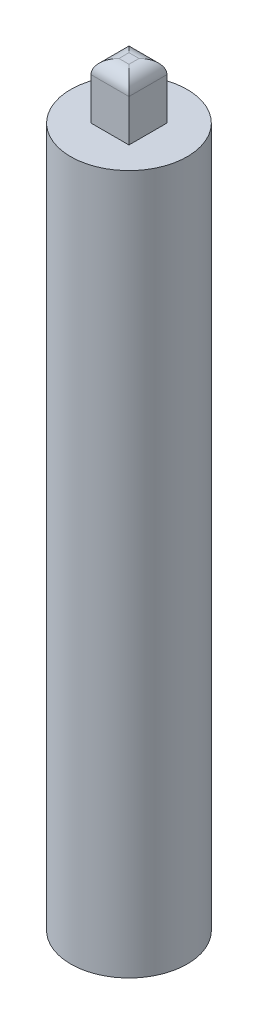
ISO-10303-21;
HEADER;
FILE_DESCRIPTION(('STEP AP214'),'2;1');
FILE_NAME('part.step','',(''),(''),'','','');
FILE_SCHEMA(('AUTOMOTIVE_DESIGN { 1 0 10303 214 1 1 1 1 }'));
ENDSEC;
DATA;
#1=APPLICATION_CONTEXT('core data for automotive mechanical design processes');
#2=APPLICATION_PROTOCOL_DEFINITION('international standard','automotive_design',2000,#1);
#3=PRODUCT_CONTEXT('',#1,'mechanical');
#4=PRODUCT('Part','Part','',(#3));
#5=PRODUCT_RELATED_PRODUCT_CATEGORY('part','',(#4));
#6=PRODUCT_DEFINITION_FORMATION('','',#4);
#7=PRODUCT_DEFINITION_CONTEXT('part definition',#1,'design');
#8=PRODUCT_DEFINITION('design','',#6,#7);
#9=PRODUCT_DEFINITION_SHAPE('','',#8);
#10=(LENGTH_UNIT() NAMED_UNIT(*) SI_UNIT(.MILLI.,.METRE.));
#11=(NAMED_UNIT(*) PLANE_ANGLE_UNIT() SI_UNIT($,.RADIAN.));
#12=(NAMED_UNIT(*) SI_UNIT($,.STERADIAN.) SOLID_ANGLE_UNIT());
#13=UNCERTAINTY_MEASURE_WITH_UNIT(LENGTH_MEASURE(1.E-05),#10,'distance_accuracy_value','');
#14=(GEOMETRIC_REPRESENTATION_CONTEXT(3) GLOBAL_UNCERTAINTY_ASSIGNED_CONTEXT((#13)) GLOBAL_UNIT_ASSIGNED_CONTEXT((#10,
#11,#12)) REPRESENTATION_CONTEXT('',''));
#15=CARTESIAN_POINT('',(0.,0.,0.));
#16=DIRECTION('',(0.,0.,1.));
#17=DIRECTION('',(1.,0.,0.));
#18=AXIS2_PLACEMENT_3D('',#15,#16,#17);
#19=CARTESIAN_POINT('',(0.,150.,0.));
#20=DIRECTION('',(0.,-1.,0.));
#21=DIRECTION('',(0.,0.,-1.));
#22=AXIS2_PLACEMENT_3D('',#19,#20,#21);
#23=CYLINDRICAL_SURFACE('',#22,12.5);
#24=CARTESIAN_POINT('',(0.,150.,0.));
#25=DIRECTION('',(0.,1.,0.));
#26=DIRECTION('',(0.,0.,1.));
#27=AXIS2_PLACEMENT_3D('',#24,#25,#26);
#28=CIRCLE('',#27,12.5);
#29=CARTESIAN_POINT('',(0.,150.,12.5));
#30=VERTEX_POINT('',#29);
#31=EDGE_CURVE('E198',#30,#30,#28,.T.);
#32=ORIENTED_EDGE('',*,*,#31,.F.);
#33=EDGE_LOOP('',(#32));
#34=FACE_BOUND('',#33,.T.);
#35=CARTESIAN_POINT('',(0.,0.,0.));
#36=DIRECTION('',(0.,1.,0.));
#37=DIRECTION('',(0.,0.,1.));
#38=AXIS2_PLACEMENT_3D('',#35,#36,#37);
#39=CIRCLE('',#38,12.5);
#40=CARTESIAN_POINT('',(0.,0.,12.5));
#41=VERTEX_POINT('',#40);
#42=EDGE_CURVE('E197',#41,#41,#39,.T.);
#43=ORIENTED_EDGE('',*,*,#42,.T.);
#44=EDGE_LOOP('',(#43));
#45=FACE_BOUND('',#44,.T.);
#46=ADVANCED_FACE('F39',(#34,#45),#23,.T.);
#47=CARTESIAN_POINT('',(0.,150.,0.));
#48=DIRECTION('',(0.,1.,0.));
#49=DIRECTION('',(0.,0.,1.));
#50=AXIS2_PLACEMENT_3D('',#47,#48,#49);
#51=PLANE('',#50);
#52=DIRECTION('',(0.,0.,-1.));
#53=VECTOR('',#52,1.);
#54=CARTESIAN_POINT('',(4.075,150.,-4.075));
#55=LINE('',#54,#53);
#56=CARTESIAN_POINT('',(4.075,150.,4.075));
#57=VERTEX_POINT('',#56);
#58=CARTESIAN_POINT('',(4.075,150.,-4.075));
#59=VERTEX_POINT('',#58);
#60=EDGE_CURVE('E169',#57,#59,#55,.T.);
#61=ORIENTED_EDGE('',*,*,#60,.F.);
#62=DIRECTION('',(1.,0.,0.));
#63=VECTOR('',#62,1.);
#64=CARTESIAN_POINT('',(-4.075,150.,4.075));
#65=LINE('',#64,#63);
#66=CARTESIAN_POINT('',(-4.075,150.,4.075));
#67=VERTEX_POINT('',#66);
#68=EDGE_CURVE('E181',#67,#57,#65,.T.);
#69=ORIENTED_EDGE('',*,*,#68,.F.);
#70=DIRECTION('',(0.,0.,1.));
#71=VECTOR('',#70,1.);
#72=CARTESIAN_POINT('',(-4.075,150.,-4.075));
#73=LINE('',#72,#71);
#74=CARTESIAN_POINT('',(-4.075,150.,-4.075));
#75=VERTEX_POINT('',#74);
#76=EDGE_CURVE('E177',#75,#67,#73,.T.);
#77=ORIENTED_EDGE('',*,*,#76,.F.);
#78=DIRECTION('',(-1.,0.,0.));
#79=VECTOR('',#78,1.);
#80=CARTESIAN_POINT('',(-4.075,150.,-4.075));
#81=LINE('',#80,#79);
#82=EDGE_CURVE('E173',#59,#75,#81,.T.);
#83=ORIENTED_EDGE('',*,*,#82,.F.);
#84=EDGE_LOOP('',(#61,#69,#77,#83));
#85=FACE_BOUND('',#84,.T.);
#86=ORIENTED_EDGE('',*,*,#31,.T.);
#87=EDGE_LOOP('',(#86));
#88=FACE_BOUND('',#87,.T.);
#89=ADVANCED_FACE('F274',(#85,#88),#51,.T.);
#90=CARTESIAN_POINT('',(0.,0.,0.));
#91=DIRECTION('',(0.,1.,0.));
#92=DIRECTION('',(0.,0.,1.));
#93=AXIS2_PLACEMENT_3D('',#90,#91,#92);
#94=PLANE('',#93);
#95=DIRECTION('',(1.,0.,0.));
#96=VECTOR('',#95,1.);
#97=CARTESIAN_POINT('',(4.1,0.,-4.1));
#98=LINE('',#97,#96);
#99=CARTESIAN_POINT('',(-4.1,0.,-4.1));
#100=VERTEX_POINT('',#99);
#101=CARTESIAN_POINT('',(4.1,0.,-4.1));
#102=VERTEX_POINT('',#101);
#103=EDGE_CURVE('E154',#100,#102,#98,.T.);
#104=ORIENTED_EDGE('',*,*,#103,.F.);
#105=DIRECTION('',(0.,0.,-1.));
#106=VECTOR('',#105,1.);
#107=CARTESIAN_POINT('',(-4.1,0.,-4.1));
#108=LINE('',#107,#106);
#109=CARTESIAN_POINT('',(-4.1,0.,4.1));
#110=VERTEX_POINT('',#109);
#111=EDGE_CURVE('E57',#110,#100,#108,.T.);
#112=ORIENTED_EDGE('',*,*,#111,.F.);
#113=DIRECTION('',(-1.,0.,0.));
#114=VECTOR('',#113,1.);
#115=CARTESIAN_POINT('',(4.1,0.,4.1));
#116=LINE('',#115,#114);
#117=CARTESIAN_POINT('',(4.1,0.,4.1));
#118=VERTEX_POINT('',#117);
#119=EDGE_CURVE('E141',#118,#110,#116,.T.);
#120=ORIENTED_EDGE('',*,*,#119,.F.);
#121=DIRECTION('',(0.,0.,1.));
#122=VECTOR('',#121,1.);
#123=CARTESIAN_POINT('',(4.1,0.,-4.1));
#124=LINE('',#123,#122);
#125=EDGE_CURVE('E145',#102,#118,#124,.T.);
#126=ORIENTED_EDGE('',*,*,#125,.F.);
#127=EDGE_LOOP('',(#104,#112,#120,#126));
#128=FACE_BOUND('',#127,.T.);
#129=ORIENTED_EDGE('',*,*,#42,.F.);
#130=EDGE_LOOP('',(#129));
#131=FACE_BOUND('',#130,.T.);
#132=ADVANCED_FACE('F280',(#128,#131),#94,.F.);
#133=CARTESIAN_POINT('',(4.075,162.,-4.075));
#134=DIRECTION('',(-1.,0.,0.));
#135=DIRECTION('',(0.,0.,1.));
#136=AXIS2_PLACEMENT_3D('',#133,#134,#135);
#137=PLANE('',#136);
#138=DIRECTION('',(0.,-1.,0.));
#139=VECTOR('',#138,1.);
#140=CARTESIAN_POINT('',(4.075,162.,-4.075));
#141=LINE('',#140,#139);
#142=CARTESIAN_POINT('',(4.075,159.,-4.075));
#143=VERTEX_POINT('',#142);
#144=EDGE_CURVE('E194',#143,#59,#141,.T.);
#145=ORIENTED_EDGE('',*,*,#144,.F.);
#146=DIRECTION('',(0.,0.,-1.));
#147=VECTOR('',#146,1.);
#148=CARTESIAN_POINT('',(4.075,159.,4.075));
#149=LINE('',#148,#147);
#150=CARTESIAN_POINT('',(4.075,159.,4.075));
#151=VERTEX_POINT('',#150);
#152=EDGE_CURVE('E222',#143,#151,#149,.F.);
#153=ORIENTED_EDGE('',*,*,#152,.T.);
#154=DIRECTION('',(0.,-1.,0.));
#155=VECTOR('',#154,1.);
#156=CARTESIAN_POINT('',(4.075,162.,4.075));
#157=LINE('',#156,#155);
#158=EDGE_CURVE('E185',#151,#57,#157,.T.);
#159=ORIENTED_EDGE('',*,*,#158,.T.);
#160=ORIENTED_EDGE('',*,*,#60,.T.);
#161=EDGE_LOOP('',(#145,#153,#159,#160));
#162=FACE_BOUND('',#161,.T.);
#163=ADVANCED_FACE('F381',(#162),#137,.F.);
#164=CARTESIAN_POINT('',(-4.075,162.,-4.075));
#165=DIRECTION('',(0.,0.,1.));
#166=DIRECTION('',(1.,0.,0.));
#167=AXIS2_PLACEMENT_3D('',#164,#165,#166);
#168=PLANE('',#167);
#169=DIRECTION('',(0.,-1.,0.));
#170=VECTOR('',#169,1.);
#171=CARTESIAN_POINT('',(-4.075,162.,-4.075));
#172=LINE('',#171,#170);
#173=CARTESIAN_POINT('',(-4.075,159.,-4.075));
#174=VERTEX_POINT('',#173);
#175=EDGE_CURVE('E191',#174,#75,#172,.T.);
#176=ORIENTED_EDGE('',*,*,#175,.F.);
#177=DIRECTION('',(-1.,0.,0.));
#178=VECTOR('',#177,1.);
#179=CARTESIAN_POINT('',(4.075,159.,-4.075));
#180=LINE('',#179,#178);
#181=EDGE_CURVE('E218',#174,#143,#180,.F.);
#182=ORIENTED_EDGE('',*,*,#181,.T.);
#183=ORIENTED_EDGE('',*,*,#144,.T.);
#184=ORIENTED_EDGE('',*,*,#82,.T.);
#185=EDGE_LOOP('',(#176,#182,#183,#184));
#186=FACE_BOUND('',#185,.T.);
#187=ADVANCED_FACE('F256',(#186),#168,.F.);
#188=CARTESIAN_POINT('',(-4.075,162.,-4.075));
#189=DIRECTION('',(1.,0.,0.));
#190=DIRECTION('',(0.,0.,-1.));
#191=AXIS2_PLACEMENT_3D('',#188,#189,#190);
#192=PLANE('',#191);
#193=DIRECTION('',(0.,-1.,0.));
#194=VECTOR('',#193,1.);
#195=CARTESIAN_POINT('',(-4.075,162.,4.075));
#196=LINE('',#195,#194);
#197=CARTESIAN_POINT('',(-4.075,159.,4.075));
#198=VERTEX_POINT('',#197);
#199=EDGE_CURVE('E188',#198,#67,#196,.T.);
#200=ORIENTED_EDGE('',*,*,#199,.F.);
#201=DIRECTION('',(0.,0.,1.));
#202=VECTOR('',#201,1.);
#203=CARTESIAN_POINT('',(-4.075,159.,-4.075));
#204=LINE('',#203,#202);
#205=EDGE_CURVE('E11',#198,#174,#204,.F.);
#206=ORIENTED_EDGE('',*,*,#205,.T.);
#207=ORIENTED_EDGE('',*,*,#175,.T.);
#208=ORIENTED_EDGE('',*,*,#76,.T.);
#209=EDGE_LOOP('',(#200,#206,#207,#208));
#210=FACE_BOUND('',#209,.T.);
#211=ADVANCED_FACE('F252',(#210),#192,.F.);
#212=CARTESIAN_POINT('',(-4.075,162.,4.075));
#213=DIRECTION('',(0.,0.,-1.));
#214=DIRECTION('',(-1.,0.,0.));
#215=AXIS2_PLACEMENT_3D('',#212,#213,#214);
#216=PLANE('',#215);
#217=ORIENTED_EDGE('',*,*,#158,.F.);
#218=DIRECTION('',(1.,0.,0.));
#219=VECTOR('',#218,1.);
#220=CARTESIAN_POINT('',(-4.075,159.,4.075));
#221=LINE('',#220,#219);
#222=EDGE_CURVE('E49',#151,#198,#221,.F.);
#223=ORIENTED_EDGE('',*,*,#222,.T.);
#224=ORIENTED_EDGE('',*,*,#199,.T.);
#225=ORIENTED_EDGE('',*,*,#68,.T.);
#226=EDGE_LOOP('',(#217,#223,#224,#225));
#227=FACE_BOUND('',#226,.T.);
#228=ADVANCED_FACE('F265',(#227),#216,.F.);
#229=CARTESIAN_POINT('',(0.,162.,0.));
#230=DIRECTION('',(0.,1.,0.));
#231=DIRECTION('',(0.,0.,1.));
#232=AXIS2_PLACEMENT_3D('',#229,#230,#231);
#233=PLANE('',#232);
#234=DIRECTION('',(0.,0.,-1.));
#235=VECTOR('',#234,1.);
#236=CARTESIAN_POINT('',(1.075,162.,-4.075));
#237=LINE('',#236,#235);
#238=CARTESIAN_POINT('',(1.075,162.,1.075));
#239=VERTEX_POINT('',#238);
#240=CARTESIAN_POINT('',(1.075,162.,-1.075));
#241=VERTEX_POINT('',#240);
#242=EDGE_CURVE('E211',#239,#241,#237,.T.);
#243=ORIENTED_EDGE('',*,*,#242,.T.);
#244=DIRECTION('',(-1.,0.,0.));
#245=VECTOR('',#244,1.);
#246=CARTESIAN_POINT('',(-4.075,162.,-1.075));
#247=LINE('',#246,#245);
#248=CARTESIAN_POINT('',(-1.075,162.,-1.075));
#249=VERTEX_POINT('',#248);
#250=EDGE_CURVE('E214',#241,#249,#247,.T.);
#251=ORIENTED_EDGE('',*,*,#250,.T.);
#252=DIRECTION('',(0.,0.,1.));
#253=VECTOR('',#252,1.);
#254=CARTESIAN_POINT('',(-1.075,162.,4.075));
#255=LINE('',#254,#253);
#256=CARTESIAN_POINT('',(-1.075,162.,1.075));
#257=VERTEX_POINT('',#256);
#258=EDGE_CURVE('E202',#249,#257,#255,.T.);
#259=ORIENTED_EDGE('',*,*,#258,.T.);
#260=DIRECTION('',(1.,0.,0.));
#261=VECTOR('',#260,1.);
#262=CARTESIAN_POINT('',(4.075,162.,1.075));
#263=LINE('',#262,#261);
#264=EDGE_CURVE('E208',#257,#239,#263,.T.);
#265=ORIENTED_EDGE('',*,*,#264,.T.);
#266=EDGE_LOOP('',(#243,#251,#259,#265));
#267=FACE_BOUND('',#266,.T.);
#268=ADVANCED_FACE('F263',(#267),#233,.T.);
#269=CARTESIAN_POINT('',(0.,159.,1.075));
#270=DIRECTION('',(-1.,0.,0.));
#271=DIRECTION('',(0.,0.,1.));
#272=AXIS2_PLACEMENT_3D('',#269,#270,#271);
#273=CYLINDRICAL_SURFACE('',#272,3.);
#274=CARTESIAN_POINT('',(-1.075,159.,1.075));
#275=DIRECTION('',(-0.707106781186548,0.,-0.707106781186547));
#276=DIRECTION('',(0.707106781186547,0.,-0.707106781186548));
#277=AXIS2_PLACEMENT_3D('',#274,#275,#276);
#278=ELLIPSE('',#277,4.24264068711928,3.);
#279=EDGE_CURVE('E231',#198,#257,#278,.T.);
#280=ORIENTED_EDGE('',*,*,#279,.F.);
#281=ORIENTED_EDGE('',*,*,#222,.F.);
#282=CARTESIAN_POINT('',(1.075,159.,1.075));
#283=DIRECTION('',(-0.707106781186547,0.,0.707106781186548));
#284=DIRECTION('',(-0.707106781186547,0.,-0.707106781186547));
#285=AXIS2_PLACEMENT_3D('',#282,#283,#284);
#286=ELLIPSE('',#285,4.24264068711929,3.);
#287=EDGE_CURVE('E43',#239,#151,#286,.F.);
#288=ORIENTED_EDGE('',*,*,#287,.F.);
#289=ORIENTED_EDGE('',*,*,#264,.F.);
#290=EDGE_LOOP('',(#280,#281,#288,#289));
#291=FACE_BOUND('',#290,.T.);
#292=ADVANCED_FACE('F41',(#291),#273,.T.);
#293=CARTESIAN_POINT('',(1.075,159.,0.));
#294=DIRECTION('',(0.,0.,1.));
#295=DIRECTION('',(1.,0.,0.));
#296=AXIS2_PLACEMENT_3D('',#293,#294,#295);
#297=CYLINDRICAL_SURFACE('',#296,3.);
#298=ORIENTED_EDGE('',*,*,#287,.T.);
#299=ORIENTED_EDGE('',*,*,#152,.F.);
#300=CARTESIAN_POINT('',(1.075,159.,-1.075));
#301=DIRECTION('',(0.707106781186547,0.,0.707106781186547));
#302=DIRECTION('',(-0.707106781186547,0.,0.707106781186548));
#303=AXIS2_PLACEMENT_3D('',#300,#301,#302);
#304=ELLIPSE('',#303,4.24264068711928,3.);
#305=EDGE_CURVE('E229',#241,#143,#304,.F.);
#306=ORIENTED_EDGE('',*,*,#305,.F.);
#307=ORIENTED_EDGE('',*,*,#242,.F.);
#308=EDGE_LOOP('',(#298,#299,#306,#307));
#309=FACE_BOUND('',#308,.T.);
#310=ADVANCED_FACE('F244',(#309),#297,.T.);
#311=CARTESIAN_POINT('',(-1.075,159.,0.));
#312=DIRECTION('',(0.,0.,-1.));
#313=DIRECTION('',(-1.,0.,0.));
#314=AXIS2_PLACEMENT_3D('',#311,#312,#313);
#315=CYLINDRICAL_SURFACE('',#314,3.);
#316=ORIENTED_EDGE('',*,*,#279,.T.);
#317=ORIENTED_EDGE('',*,*,#258,.F.);
#318=CARTESIAN_POINT('',(-1.075,159.,-1.075));
#319=DIRECTION('',(0.707106781186547,0.,-0.707106781186548));
#320=DIRECTION('',(-0.707106781186548,0.,-0.707106781186547));
#321=AXIS2_PLACEMENT_3D('',#318,#319,#320);
#322=ELLIPSE('',#321,4.24264068711929,3.);
#323=EDGE_CURVE('E163',#174,#249,#322,.T.);
#324=ORIENTED_EDGE('',*,*,#323,.F.);
#325=ORIENTED_EDGE('',*,*,#205,.F.);
#326=EDGE_LOOP('',(#316,#317,#324,#325));
#327=FACE_BOUND('',#326,.T.);
#328=ADVANCED_FACE('F249',(#327),#315,.T.);
#329=CARTESIAN_POINT('',(0.,159.,-1.075));
#330=DIRECTION('',(1.,0.,0.));
#331=DIRECTION('',(0.,0.,-1.));
#332=AXIS2_PLACEMENT_3D('',#329,#330,#331);
#333=CYLINDRICAL_SURFACE('',#332,3.);
#334=ORIENTED_EDGE('',*,*,#305,.T.);
#335=ORIENTED_EDGE('',*,*,#181,.F.);
#336=ORIENTED_EDGE('',*,*,#323,.T.);
#337=ORIENTED_EDGE('',*,*,#250,.F.);
#338=EDGE_LOOP('',(#334,#335,#336,#337));
#339=FACE_BOUND('',#338,.T.);
#340=ADVANCED_FACE('F260',(#339),#333,.T.);
#341=CARTESIAN_POINT('',(-4.1,20.,-4.1));
#342=DIRECTION('',(-1.,0.,0.));
#343=DIRECTION('',(0.,0.,1.));
#344=AXIS2_PLACEMENT_3D('',#341,#342,#343);
#345=PLANE('',#344);
#346=ORIENTED_EDGE('',*,*,#111,.T.);
#347=DIRECTION('',(0.,-1.,0.));
#348=VECTOR('',#347,1.);
#349=CARTESIAN_POINT('',(-4.1,20.,-4.1));
#350=LINE('',#349,#348);
#351=CARTESIAN_POINT('',(-4.1,20.,-4.1));
#352=VERTEX_POINT('',#351);
#353=EDGE_CURVE('E116',#352,#100,#350,.T.);
#354=ORIENTED_EDGE('',*,*,#353,.F.);
#355=DIRECTION('',(0.,0.,-1.));
#356=VECTOR('',#355,1.);
#357=CARTESIAN_POINT('',(-4.1,20.,-4.1));
#358=LINE('',#357,#356);
#359=CARTESIAN_POINT('',(-4.1,20.,4.1));
#360=VERTEX_POINT('',#359);
#361=EDGE_CURVE('E120',#360,#352,#358,.T.);
#362=ORIENTED_EDGE('',*,*,#361,.F.);
#363=DIRECTION('',(0.,-1.,0.));
#364=VECTOR('',#363,1.);
#365=CARTESIAN_POINT('',(-4.1,20.,4.1));
#366=LINE('',#365,#364);
#367=EDGE_CURVE('E160',#360,#110,#366,.T.);
#368=ORIENTED_EDGE('',*,*,#367,.T.);
#369=EDGE_LOOP('',(#346,#354,#362,#368));
#370=FACE_BOUND('',#369,.T.);
#371=ADVANCED_FACE('F118',(#370),#345,.F.);
#372=CARTESIAN_POINT('',(4.1,20.,4.1));
#373=DIRECTION('',(0.,0.,1.));
#374=DIRECTION('',(1.,0.,0.));
#375=AXIS2_PLACEMENT_3D('',#372,#373,#374);
#376=PLANE('',#375);
#377=ORIENTED_EDGE('',*,*,#119,.T.);
#378=ORIENTED_EDGE('',*,*,#367,.F.);
#379=DIRECTION('',(-1.,0.,0.));
#380=VECTOR('',#379,1.);
#381=CARTESIAN_POINT('',(4.1,20.,4.1));
#382=LINE('',#381,#380);
#383=CARTESIAN_POINT('',(4.1,20.,4.1));
#384=VERTEX_POINT('',#383);
#385=EDGE_CURVE('E127',#384,#360,#382,.T.);
#386=ORIENTED_EDGE('',*,*,#385,.F.);
#387=DIRECTION('',(0.,-1.,0.));
#388=VECTOR('',#387,1.);
#389=CARTESIAN_POINT('',(4.1,20.,4.1));
#390=LINE('',#389,#388);
#391=EDGE_CURVE('E164',#384,#118,#390,.T.);
#392=ORIENTED_EDGE('',*,*,#391,.T.);
#393=EDGE_LOOP('',(#377,#378,#386,#392));
#394=FACE_BOUND('',#393,.T.);
#395=ADVANCED_FACE('F310',(#394),#376,.F.);
#396=CARTESIAN_POINT('',(4.1,20.,-4.1));
#397=DIRECTION('',(1.,0.,0.));
#398=DIRECTION('',(0.,0.,-1.));
#399=AXIS2_PLACEMENT_3D('',#396,#397,#398);
#400=PLANE('',#399);
#401=ORIENTED_EDGE('',*,*,#125,.T.);
#402=ORIENTED_EDGE('',*,*,#391,.F.);
#403=DIRECTION('',(0.,0.,1.));
#404=VECTOR('',#403,1.);
#405=CARTESIAN_POINT('',(4.1,20.,-4.1));
#406=LINE('',#405,#404);
#407=CARTESIAN_POINT('',(4.1,20.,-4.1));
#408=VERTEX_POINT('',#407);
#409=EDGE_CURVE('E136',#408,#384,#406,.T.);
#410=ORIENTED_EDGE('',*,*,#409,.F.);
#411=DIRECTION('',(0.,-1.,0.));
#412=VECTOR('',#411,1.);
#413=CARTESIAN_POINT('',(4.1,20.,-4.1));
#414=LINE('',#413,#412);
#415=EDGE_CURVE('E126',#408,#102,#414,.T.);
#416=ORIENTED_EDGE('',*,*,#415,.T.);
#417=EDGE_LOOP('',(#401,#402,#410,#416));
#418=FACE_BOUND('',#417,.T.);
#419=ADVANCED_FACE('F316',(#418),#400,.F.);
#420=CARTESIAN_POINT('',(4.1,20.,-4.1));
#421=DIRECTION('',(0.,0.,-1.));
#422=DIRECTION('',(-1.,0.,0.));
#423=AXIS2_PLACEMENT_3D('',#420,#421,#422);
#424=PLANE('',#423);
#425=ORIENTED_EDGE('',*,*,#103,.T.);
#426=ORIENTED_EDGE('',*,*,#415,.F.);
#427=DIRECTION('',(1.,0.,0.));
#428=VECTOR('',#427,1.);
#429=CARTESIAN_POINT('',(4.1,20.,-4.1));
#430=LINE('',#429,#428);
#431=EDGE_CURVE('E130',#352,#408,#430,.T.);
#432=ORIENTED_EDGE('',*,*,#431,.F.);
#433=ORIENTED_EDGE('',*,*,#353,.T.);
#434=EDGE_LOOP('',(#425,#426,#432,#433));
#435=FACE_BOUND('',#434,.T.);
#436=ADVANCED_FACE('F131',(#435),#424,.F.);
#437=CARTESIAN_POINT('',(0.,20.,0.));
#438=DIRECTION('',(0.,-1.,0.));
#439=DIRECTION('',(0.,0.,-1.));
#440=AXIS2_PLACEMENT_3D('',#437,#438,#439);
#441=PLANE('',#440);
#442=ORIENTED_EDGE('',*,*,#361,.T.);
#443=ORIENTED_EDGE('',*,*,#431,.T.);
#444=ORIENTED_EDGE('',*,*,#409,.T.);
#445=ORIENTED_EDGE('',*,*,#385,.T.);
#446=EDGE_LOOP('',(#442,#443,#444,#445));
#447=FACE_BOUND('',#446,.T.);
#448=ADVANCED_FACE('F138',(#447),#441,.T.);
#449=CLOSED_SHELL('',(#46,#89,#132,#163,#187,#211,#228,#268,#292,#310,#328,#340,#371,#395,#419,
#436,#448));
#450=MANIFOLD_SOLID_BREP('B2',#449);
#451=ADVANCED_BREP_SHAPE_REPRESENTATION('',(#18,#450),#14);
#452=SHAPE_DEFINITION_REPRESENTATION(#9,#451);
ENDSEC;
END-ISO-10303-21;
